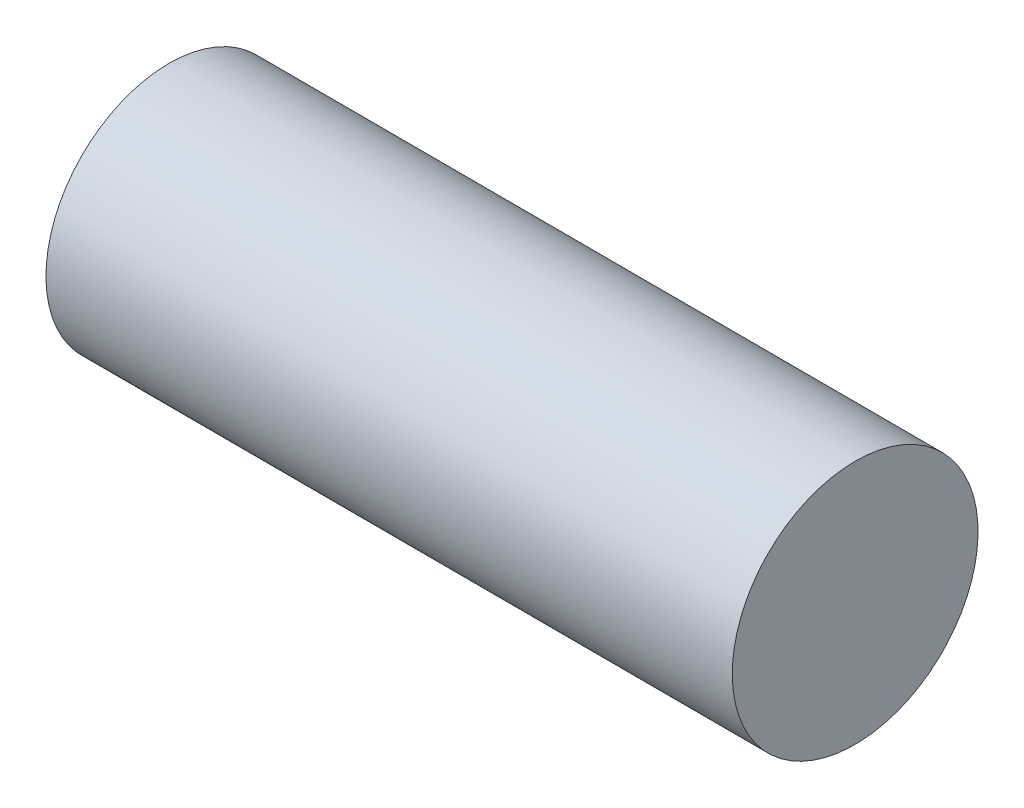
ISO-10303-21;
HEADER;
FILE_DESCRIPTION(('STEP AP214'),'2;1');
FILE_NAME('part.step','',(''),(''),'','','');
FILE_SCHEMA(('AUTOMOTIVE_DESIGN { 1 0 10303 214 1 1 1 1 }'));
ENDSEC;
DATA;
#1=APPLICATION_CONTEXT('core data for automotive mechanical design processes');
#2=APPLICATION_PROTOCOL_DEFINITION('international standard','automotive_design',2000,#1);
#3=PRODUCT_CONTEXT('',#1,'mechanical');
#4=PRODUCT('Part','Part','',(#3));
#5=PRODUCT_RELATED_PRODUCT_CATEGORY('part','',(#4));
#6=PRODUCT_DEFINITION_FORMATION('','',#4);
#7=PRODUCT_DEFINITION_CONTEXT('part definition',#1,'design');
#8=PRODUCT_DEFINITION('design','',#6,#7);
#9=PRODUCT_DEFINITION_SHAPE('','',#8);
#10=(LENGTH_UNIT() NAMED_UNIT(*) SI_UNIT(.MILLI.,.METRE.));
#11=(NAMED_UNIT(*) PLANE_ANGLE_UNIT() SI_UNIT($,.RADIAN.));
#12=(NAMED_UNIT(*) SI_UNIT($,.STERADIAN.) SOLID_ANGLE_UNIT());
#13=UNCERTAINTY_MEASURE_WITH_UNIT(LENGTH_MEASURE(1.E-05),#10,'distance_accuracy_value','');
#14=(GEOMETRIC_REPRESENTATION_CONTEXT(3) GLOBAL_UNCERTAINTY_ASSIGNED_CONTEXT((#13)) GLOBAL_UNIT_ASSIGNED_CONTEXT((#10,
#11,#12)) REPRESENTATION_CONTEXT('',''));
#15=CARTESIAN_POINT('',(0.,0.,0.));
#16=DIRECTION('',(0.,0.,1.));
#17=DIRECTION('',(1.,0.,0.));
#18=AXIS2_PLACEMENT_3D('',#15,#16,#17);
#19=CARTESIAN_POINT('',(-13.5580424451285,200.895063598058,163.321796860767));
#20=DIRECTION('',(0.999998204569047,-0.00189495611617016,-1.97773542619787E-09));
#21=DIRECTION('',(0.00189495611617016,0.999998204569047,0.));
#22=AXIS2_PLACEMENT_3D('',#19,#20,#21);
#23=PLANE('',#22);
#24=CARTESIAN_POINT('',(-13.5580424451285,200.895063598058,163.321796860767));
#25=DIRECTION('',(0.999998204569047,-0.00189495611617016,-1.97773542619787E-09));
#26=DIRECTION('',(0.00189495611617016,0.999998204569047,0.));
#27=AXIS2_PLACEMENT_3D('',#24,#25,#26);
#28=CIRCLE('',#27,4.69900000000001);
#29=CARTESIAN_POINT('',(-13.5491380463386,205.594055161327,163.321796860767));
#30=VERTEX_POINT('',#29);
#31=EDGE_CURVE('E45',#30,#30,#28,.T.);
#32=ORIENTED_EDGE('',*,*,#31,.F.);
#33=EDGE_LOOP('',(#32));
#34=FACE_BOUND('',#33,.T.);
#35=ADVANCED_FACE('F39',(#34),#23,.F.);
#36=CARTESIAN_POINT('',(12.6858057643378,200.845332568093,163.321796808863));
#37=DIRECTION('',(0.999998204569047,-0.00189495611617016,-1.97773542619787E-09));
#38=DIRECTION('',(0.00189495611617016,0.999998204569047,0.));
#39=AXIS2_PLACEMENT_3D('',#36,#37,#38);
#40=PLANE('',#39);
#41=CARTESIAN_POINT('',(12.6858057643378,200.845332568093,163.321796808863));
#42=DIRECTION('',(0.999998204569047,-0.00189495611617016,-1.97773542619787E-09));
#43=DIRECTION('',(0.00189495611617016,0.999998204569047,0.));
#44=AXIS2_PLACEMENT_3D('',#41,#42,#43);
#45=CIRCLE('',#44,4.69900000000001);
#46=CARTESIAN_POINT('',(12.6947101631277,205.544324131363,163.321796808863));
#47=VERTEX_POINT('',#46);
#48=EDGE_CURVE('E11',#47,#47,#45,.T.);
#49=ORIENTED_EDGE('',*,*,#48,.T.);
#50=EDGE_LOOP('',(#49));
#51=FACE_BOUND('',#50,.T.);
#52=ADVANCED_FACE('F54',(#51),#40,.T.);
#53=CARTESIAN_POINT('',(-13.5580424451285,200.895063598058,163.321796860767));
#54=DIRECTION('',(0.999998204569047,-0.0018949561161691,-1.97773542619787E-09));
#55=DIRECTION('',(0.0018949561161691,0.999998204569047,0.));
#56=AXIS2_PLACEMENT_3D('',#53,#54,#55);
#57=CYLINDRICAL_SURFACE('',#56,4.69900000000001);
#58=ORIENTED_EDGE('',*,*,#48,.F.);
#59=EDGE_LOOP('',(#58));
#60=FACE_BOUND('',#59,.T.);
#61=ORIENTED_EDGE('',*,*,#31,.T.);
#62=EDGE_LOOP('',(#61));
#63=FACE_BOUND('',#62,.T.);
#64=ADVANCED_FACE('F51',(#60,#63),#57,.T.);
#65=CLOSED_SHELL('',(#35,#52,#64));
#66=MANIFOLD_SOLID_BREP('B2',#65);
#67=ADVANCED_BREP_SHAPE_REPRESENTATION('',(#18,#66),#14);
#68=SHAPE_DEFINITION_REPRESENTATION(#9,#67);
ENDSEC;
END-ISO-10303-21;
